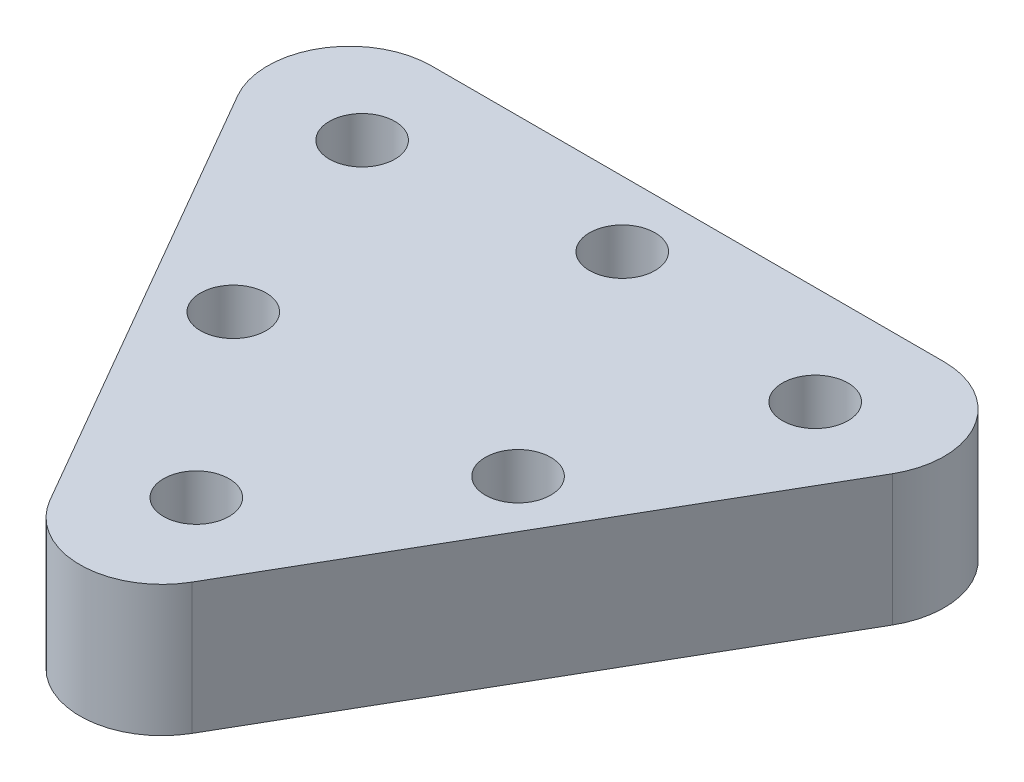
ISO-10303-21;
HEADER;
FILE_DESCRIPTION(('STEP AP214'),'2;1');
FILE_NAME('part.step','',(''),(''),'','','');
FILE_SCHEMA(('AUTOMOTIVE_DESIGN { 1 0 10303 214 1 1 1 1 }'));
ENDSEC;
DATA;
#1=APPLICATION_CONTEXT('core data for automotive mechanical design processes');
#2=APPLICATION_PROTOCOL_DEFINITION('international standard','automotive_design',2000,#1);
#3=PRODUCT_CONTEXT('',#1,'mechanical');
#4=PRODUCT('Part','Part','',(#3));
#5=PRODUCT_RELATED_PRODUCT_CATEGORY('part','',(#4));
#6=PRODUCT_DEFINITION_FORMATION('','',#4);
#7=PRODUCT_DEFINITION_CONTEXT('part definition',#1,'design');
#8=PRODUCT_DEFINITION('design','',#6,#7);
#9=PRODUCT_DEFINITION_SHAPE('','',#8);
#10=(LENGTH_UNIT() NAMED_UNIT(*) SI_UNIT(.MILLI.,.METRE.));
#11=(NAMED_UNIT(*) PLANE_ANGLE_UNIT() SI_UNIT($,.RADIAN.));
#12=(NAMED_UNIT(*) SI_UNIT($,.STERADIAN.) SOLID_ANGLE_UNIT());
#13=UNCERTAINTY_MEASURE_WITH_UNIT(LENGTH_MEASURE(1.E-05),#10,'distance_accuracy_value','');
#14=(GEOMETRIC_REPRESENTATION_CONTEXT(3) GLOBAL_UNCERTAINTY_ASSIGNED_CONTEXT((#13)) GLOBAL_UNIT_ASSIGNED_CONTEXT((#10,
#11,#12)) REPRESENTATION_CONTEXT('',''));
#15=CARTESIAN_POINT('',(0.,0.,0.));
#16=DIRECTION('',(0.,0.,1.));
#17=DIRECTION('',(1.,0.,0.));
#18=AXIS2_PLACEMENT_3D('',#15,#16,#17);
#19=CARTESIAN_POINT('',(-16.4111309816013,0.,1.40670066691386));
#20=DIRECTION('',(0.,1.,0.));
#21=DIRECTION('',(0.,0.,1.));
#22=AXIS2_PLACEMENT_3D('',#19,#20,#21);
#23=PLANE('',#22);
#24=CARTESIAN_POINT('',(0.457896150652304,0.,2.45939375576491));
#25=DIRECTION('',(0.,-1.,0.));
#26=DIRECTION('',(0.,0.,-1.));
#27=AXIS2_PLACEMENT_3D('',#24,#25,#26);
#28=CIRCLE('',#27,0.999999999999989);
#29=CARTESIAN_POINT('',(0.457896150652304,0.,1.45939375576492));
#30=VERTEX_POINT('',#29);
#31=EDGE_CURVE('E168',#30,#30,#28,.T.);
#32=ORIENTED_EDGE('',*,*,#31,.F.);
#33=EDGE_LOOP('',(#32));
#34=FACE_BOUND('',#33,.T.);
#35=CARTESIAN_POINT('',(9.14769453551465,0.,2.45939375576486));
#36=DIRECTION('',(0.,-1.,0.));
#37=DIRECTION('',(0.,0.,-1.));
#38=AXIS2_PLACEMENT_3D('',#35,#36,#37);
#39=CIRCLE('',#38,0.999999999999989);
#40=CARTESIAN_POINT('',(9.14769453551465,0.,1.45939375576487));
#41=VERTEX_POINT('',#40);
#42=EDGE_CURVE('E158',#41,#41,#39,.T.);
#43=ORIENTED_EDGE('',*,*,#42,.F.);
#44=EDGE_LOOP('',(#43));
#45=FACE_BOUND('',#44,.T.);
#46=CARTESIAN_POINT('',(4.80279534308345,0.,-5.06619239929081));
#47=DIRECTION('',(0.,-1.,0.));
#48=DIRECTION('',(0.,0.,-1.));
#49=AXIS2_PLACEMENT_3D('',#46,#47,#48);
#50=CIRCLE('',#49,0.999999999999989);
#51=CARTESIAN_POINT('',(4.80279534308345,0.,-6.06619239929079));
#52=VERTEX_POINT('',#51);
#53=EDGE_CURVE('E155',#52,#52,#50,.T.);
#54=ORIENTED_EDGE('',*,*,#53,.F.);
#55=EDGE_LOOP('',(#54));
#56=FACE_BOUND('',#55,.T.);
#57=CARTESIAN_POINT('',(4.80279534308345,0.,-0.0491349625871208));
#58=DIRECTION('',(0.,-1.,0.));
#59=DIRECTION('',(0.,0.,-1.));
#60=AXIS2_PLACEMENT_3D('',#57,#58,#59);
#61=CIRCLE('',#60,0.799999999999999);
#62=CARTESIAN_POINT('',(4.80279534308345,0.,-0.84913496258712));
#63=VERTEX_POINT('',#62);
#64=EDGE_CURVE('E154',#63,#63,#61,.T.);
#65=ORIENTED_EDGE('',*,*,#64,.F.);
#66=EDGE_LOOP('',(#65));
#67=FACE_BOUND('',#66,.T.);
#68=CARTESIAN_POINT('',(11.71622639985,0.,-4.04060624423512));
#69=DIRECTION('',(0.,1.,0.));
#70=DIRECTION('',(0.,0.,1.));
#71=AXIS2_PLACEMENT_3D('',#68,#69,#70);
#72=CIRCLE('',#71,2.38124999999938);
#73=CARTESIAN_POINT('',(11.71622639985,0.,-1.65935624423574));
#74=VERTEX_POINT('',#73);
#75=EDGE_CURVE('E181',#74,#74,#72,.T.);
#76=ORIENTED_EDGE('',*,*,#75,.T.);
#77=EDGE_LOOP('',(#76));
#78=FACE_BOUND('',#77,.T.);
#79=CARTESIAN_POINT('',(4.80279534308331,0.,8.98497991082108));
#80=DIRECTION('',(0.,1.,0.));
#81=DIRECTION('',(0.,0.,1.));
#82=AXIS2_PLACEMENT_3D('',#79,#80,#81);
#83=CIRCLE('',#82,2.49999999999972);
#84=CARTESIAN_POINT('',(6.96785885254439,0.,10.2349799108209));
#85=VERTEX_POINT('',#84);
#86=CARTESIAN_POINT('',(2.63773183362258,0.,10.2349799108209));
#87=VERTEX_POINT('',#86);
#88=EDGE_CURVE('E126',#85,#87,#83,.F.);
#89=ORIENTED_EDGE('',*,*,#88,.T.);
#90=DIRECTION('',(0.500000000000009,0.,0.866025403784434));
#91=VECTOR('',#90,1.);
#92=CARTESIAN_POINT('',(-5.94724091864677,0.,-4.63462907770371));
#93=LINE('',#92,#91);
#94=CARTESIAN_POINT('',(-5.18604114745575,0.,-3.3161923992911));
#95=VERTEX_POINT('',#94);
#96=EDGE_CURVE('E139',#95,#87,#93,.T.);
#97=ORIENTED_EDGE('',*,*,#96,.F.);
#98=CARTESIAN_POINT('',(-3.02097763799502,0.,-4.56619239929088));
#99=DIRECTION('',(0.,1.,0.));
#100=DIRECTION('',(0.,0.,1.));
#101=AXIS2_PLACEMENT_3D('',#98,#99,#100);
#102=CIRCLE('',#101,2.49999999999975);
#103=CARTESIAN_POINT('',(-3.02097763799485,0.,-7.06619239929081));
#104=VERTEX_POINT('',#103);
#105=EDGE_CURVE('E137',#95,#104,#102,.F.);
#106=ORIENTED_EDGE('',*,*,#105,.T.);
#107=DIRECTION('',(-1.,0.,0.));
#108=VECTOR('',#107,1.);
#109=CARTESIAN_POINT('',(-16.4111309816013,0.,-7.06619239929081));
#110=LINE('',#109,#108);
#111=CARTESIAN_POINT('',(12.6265683241618,0.,-7.06619239929081));
#112=VERTEX_POINT('',#111);
#113=EDGE_CURVE('E109',#112,#104,#110,.T.);
#114=ORIENTED_EDGE('',*,*,#113,.F.);
#115=CARTESIAN_POINT('',(12.6265683241616,0.,-4.56619239929093));
#116=DIRECTION('',(0.,1.,0.));
#117=DIRECTION('',(0.,0.,1.));
#118=AXIS2_PLACEMENT_3D('',#115,#116,#117);
#119=CIRCLE('',#118,2.49999999999987);
#120=CARTESIAN_POINT('',(14.7916318336227,0.,-3.31619239929111));
#121=VERTEX_POINT('',#120);
#122=EDGE_CURVE('E133',#121,#112,#119,.T.);
#123=ORIENTED_EDGE('',*,*,#122,.F.);
#124=DIRECTION('',(0.500000000000006,0.,-0.866025403784435));
#125=VECTOR('',#124,1.);
#126=CARTESIAN_POINT('',(4.94586844247103,0.,13.7371700334849));
#127=LINE('',#126,#125);
#128=EDGE_CURVE('E129',#85,#121,#127,.T.);
#129=ORIENTED_EDGE('',*,*,#128,.F.);
#130=EDGE_LOOP('',(#89,#97,#106,#114,#123,#129));
#131=FACE_BOUND('',#130,.T.);
#132=CARTESIAN_POINT('',(4.80279534308406,0.,7.93380760070919));
#133=DIRECTION('',(0.,1.,0.));
#134=DIRECTION('',(0.,0.,1.));
#135=AXIS2_PLACEMENT_3D('',#132,#133,#134);
#136=CIRCLE('',#135,2.38124999999972);
#137=CARTESIAN_POINT('',(4.80279534308406,0.,10.3150576007089));
#138=VERTEX_POINT('',#137);
#139=EDGE_CURVE('E184',#138,#138,#136,.T.);
#140=ORIENTED_EDGE('',*,*,#139,.T.);
#141=EDGE_LOOP('',(#140));
#142=FACE_BOUND('',#141,.T.);
#143=CARTESIAN_POINT('',(-2.11063571368305,0.,-4.04060624423513));
#144=DIRECTION('',(0.,1.,0.));
#145=DIRECTION('',(0.,0.,1.));
#146=AXIS2_PLACEMENT_3D('',#143,#144,#145);
#147=CIRCLE('',#146,2.38124999999953);
#148=CARTESIAN_POINT('',(-2.11063571368305,0.,-1.6593562442356));
#149=VERTEX_POINT('',#148);
#150=EDGE_CURVE('E151',#149,#149,#147,.T.);
#151=ORIENTED_EDGE('',*,*,#150,.T.);
#152=EDGE_LOOP('',(#151));
#153=FACE_BOUND('',#152,.T.);
#154=ADVANCED_FACE('F33',(#34,#45,#56,#67,#78,#131,#142,#153),#23,.F.);
#155=CARTESIAN_POINT('',(4.80279534308331,4.,8.98497991082108));
#156=DIRECTION('',(0.,-1.,0.));
#157=DIRECTION('',(0.,0.,-1.));
#158=AXIS2_PLACEMENT_3D('',#155,#156,#157);
#159=CYLINDRICAL_SURFACE('',#158,2.49999999999972);
#160=ORIENTED_EDGE('',*,*,#88,.F.);
#161=DIRECTION('',(0.,-1.,0.));
#162=VECTOR('',#161,1.);
#163=CARTESIAN_POINT('',(6.96785885254439,4.,10.2349799108209));
#164=LINE('',#163,#162);
#165=CARTESIAN_POINT('',(6.96785885254439,4.,10.2349799108209));
#166=VERTEX_POINT('',#165);
#167=EDGE_CURVE('E11',#166,#85,#164,.T.);
#168=ORIENTED_EDGE('',*,*,#167,.F.);
#169=CARTESIAN_POINT('',(4.80279534308331,4.,8.98497991082108));
#170=DIRECTION('',(0.,1.,0.));
#171=DIRECTION('',(0.,0.,1.));
#172=AXIS2_PLACEMENT_3D('',#169,#170,#171);
#173=CIRCLE('',#172,2.49999999999972);
#174=CARTESIAN_POINT('',(2.63773183362258,4.,10.2349799108209));
#175=VERTEX_POINT('',#174);
#176=EDGE_CURVE('E199',#166,#175,#173,.F.);
#177=ORIENTED_EDGE('',*,*,#176,.T.);
#178=DIRECTION('',(0.,-1.,0.));
#179=VECTOR('',#178,1.);
#180=CARTESIAN_POINT('',(2.63773183362258,4.,10.2349799108209));
#181=LINE('',#180,#179);
#182=EDGE_CURVE('E81',#175,#87,#181,.T.);
#183=ORIENTED_EDGE('',*,*,#182,.T.);
#184=EDGE_LOOP('',(#160,#168,#177,#183));
#185=FACE_BOUND('',#184,.T.);
#186=ADVANCED_FACE('F211',(#185),#159,.T.);
#187=CARTESIAN_POINT('',(4.94586844247103,4.,13.7371700334849));
#188=DIRECTION('',(-0.866025403784435,0.,-0.500000000000006));
#189=DIRECTION('',(-0.500000000000006,0.,0.866025403784435));
#190=AXIS2_PLACEMENT_3D('',#187,#188,#189);
#191=PLANE('',#190);
#192=ORIENTED_EDGE('',*,*,#128,.T.);
#193=DIRECTION('',(0.,-1.,0.));
#194=VECTOR('',#193,1.);
#195=CARTESIAN_POINT('',(14.7916318336227,4.,-3.31619239929111));
#196=LINE('',#195,#194);
#197=CARTESIAN_POINT('',(14.7916318336227,4.,-3.31619239929111));
#198=VERTEX_POINT('',#197);
#199=EDGE_CURVE('E43',#198,#121,#196,.T.);
#200=ORIENTED_EDGE('',*,*,#199,.F.);
#201=DIRECTION('',(0.500000000000006,0.,-0.866025403784435));
#202=VECTOR('',#201,1.);
#203=CARTESIAN_POINT('',(4.94586844247103,4.,13.7371700334849));
#204=LINE('',#203,#202);
#205=EDGE_CURVE('E201',#166,#198,#204,.T.);
#206=ORIENTED_EDGE('',*,*,#205,.F.);
#207=ORIENTED_EDGE('',*,*,#167,.T.);
#208=EDGE_LOOP('',(#192,#200,#206,#207));
#209=FACE_BOUND('',#208,.T.);
#210=ADVANCED_FACE('F204',(#209),#191,.F.);
#211=CARTESIAN_POINT('',(12.6265683241616,4.,-4.56619239929093));
#212=DIRECTION('',(0.,-1.,0.));
#213=DIRECTION('',(0.,0.,-1.));
#214=AXIS2_PLACEMENT_3D('',#211,#212,#213);
#215=CYLINDRICAL_SURFACE('',#214,2.49999999999987);
#216=ORIENTED_EDGE('',*,*,#122,.T.);
#217=DIRECTION('',(0.,-1.,0.));
#218=VECTOR('',#217,1.);
#219=CARTESIAN_POINT('',(12.6265683241618,4.,-7.06619239929081));
#220=LINE('',#219,#218);
#221=CARTESIAN_POINT('',(12.6265683241618,4.,-7.06619239929081));
#222=VERTEX_POINT('',#221);
#223=EDGE_CURVE('E113',#222,#112,#220,.T.);
#224=ORIENTED_EDGE('',*,*,#223,.F.);
#225=CARTESIAN_POINT('',(12.6265683241616,4.,-4.56619239929093));
#226=DIRECTION('',(0.,1.,0.));
#227=DIRECTION('',(0.,0.,1.));
#228=AXIS2_PLACEMENT_3D('',#225,#226,#227);
#229=CIRCLE('',#228,2.49999999999987);
#230=EDGE_CURVE('E101',#198,#222,#229,.T.);
#231=ORIENTED_EDGE('',*,*,#230,.F.);
#232=ORIENTED_EDGE('',*,*,#199,.T.);
#233=EDGE_LOOP('',(#216,#224,#231,#232));
#234=FACE_BOUND('',#233,.T.);
#235=ADVANCED_FACE('F207',(#234),#215,.T.);
#236=CARTESIAN_POINT('',(-16.4111309816013,4.,-7.06619239929081));
#237=DIRECTION('',(0.,0.,1.));
#238=DIRECTION('',(1.,0.,0.));
#239=AXIS2_PLACEMENT_3D('',#236,#237,#238);
#240=PLANE('',#239);
#241=ORIENTED_EDGE('',*,*,#113,.T.);
#242=DIRECTION('',(0.,-1.,0.));
#243=VECTOR('',#242,1.);
#244=CARTESIAN_POINT('',(-3.02097763799485,4.,-7.06619239929081));
#245=LINE('',#244,#243);
#246=CARTESIAN_POINT('',(-3.02097763799485,4.,-7.06619239929081));
#247=VERTEX_POINT('',#246);
#248=EDGE_CURVE('E107',#247,#104,#245,.T.);
#249=ORIENTED_EDGE('',*,*,#248,.F.);
#250=DIRECTION('',(-1.,0.,0.));
#251=VECTOR('',#250,1.);
#252=CARTESIAN_POINT('',(-16.4111309816013,4.,-7.06619239929081));
#253=LINE('',#252,#251);
#254=EDGE_CURVE('E94',#222,#247,#253,.T.);
#255=ORIENTED_EDGE('',*,*,#254,.F.);
#256=ORIENTED_EDGE('',*,*,#223,.T.);
#257=EDGE_LOOP('',(#241,#249,#255,#256));
#258=FACE_BOUND('',#257,.T.);
#259=ADVANCED_FACE('F108',(#258),#240,.F.);
#260=CARTESIAN_POINT('',(-3.02097763799502,4.,-4.56619239929088));
#261=DIRECTION('',(0.,-1.,0.));
#262=DIRECTION('',(0.,0.,-1.));
#263=AXIS2_PLACEMENT_3D('',#260,#261,#262);
#264=CYLINDRICAL_SURFACE('',#263,2.49999999999975);
#265=ORIENTED_EDGE('',*,*,#105,.F.);
#266=DIRECTION('',(0.,-1.,0.));
#267=VECTOR('',#266,1.);
#268=CARTESIAN_POINT('',(-5.18604114745575,4.,-3.3161923992911));
#269=LINE('',#268,#267);
#270=CARTESIAN_POINT('',(-5.18604114745575,4.,-3.3161923992911));
#271=VERTEX_POINT('',#270);
#272=EDGE_CURVE('E74',#271,#95,#269,.T.);
#273=ORIENTED_EDGE('',*,*,#272,.F.);
#274=CARTESIAN_POINT('',(-3.02097763799502,4.,-4.56619239929088));
#275=DIRECTION('',(0.,1.,0.));
#276=DIRECTION('',(0.,0.,1.));
#277=AXIS2_PLACEMENT_3D('',#274,#275,#276);
#278=CIRCLE('',#277,2.49999999999975);
#279=EDGE_CURVE('E99',#271,#247,#278,.F.);
#280=ORIENTED_EDGE('',*,*,#279,.T.);
#281=ORIENTED_EDGE('',*,*,#248,.T.);
#282=EDGE_LOOP('',(#265,#273,#280,#281));
#283=FACE_BOUND('',#282,.T.);
#284=ADVANCED_FACE('F115',(#283),#264,.T.);
#285=CARTESIAN_POINT('',(4.80279534308406,4.,7.93380760070919));
#286=DIRECTION('',(0.,-1.,0.));
#287=DIRECTION('',(0.,0.,-1.));
#288=AXIS2_PLACEMENT_3D('',#285,#286,#287);
#289=CYLINDRICAL_SURFACE('',#288,0.999999999998708);
#290=CARTESIAN_POINT('',(4.80279534308406,2.,7.93380760070919));
#291=DIRECTION('',(0.,1.,0.));
#292=DIRECTION('',(0.,0.,1.));
#293=AXIS2_PLACEMENT_3D('',#290,#291,#292);
#294=CIRCLE('',#293,0.999999999998708);
#295=CARTESIAN_POINT('',(4.80279534308406,2.,8.9338076007079));
#296=VERTEX_POINT('',#295);
#297=EDGE_CURVE('E190',#296,#296,#294,.T.);
#298=ORIENTED_EDGE('',*,*,#297,.F.);
#299=EDGE_LOOP('',(#298));
#300=FACE_BOUND('',#299,.T.);
#301=CARTESIAN_POINT('',(4.80279534308406,4.,7.93380760070919));
#302=DIRECTION('',(0.,1.,0.));
#303=DIRECTION('',(0.,0.,1.));
#304=AXIS2_PLACEMENT_3D('',#301,#302,#303);
#305=CIRCLE('',#304,0.999999999998708);
#306=CARTESIAN_POINT('',(4.80279534308406,4.,8.9338076007079));
#307=VERTEX_POINT('',#306);
#308=EDGE_CURVE('E117',#307,#307,#305,.T.);
#309=ORIENTED_EDGE('',*,*,#308,.T.);
#310=EDGE_LOOP('',(#309));
#311=FACE_BOUND('',#310,.T.);
#312=ADVANCED_FACE('F228',(#300,#311),#289,.F.);
#313=CARTESIAN_POINT('',(-5.94724091864677,4.,-4.63462907770371));
#314=DIRECTION('',(0.866025403784433,0.,-0.500000000000009));
#315=DIRECTION('',(-0.500000000000009,0.,-0.866025403784434));
#316=AXIS2_PLACEMENT_3D('',#313,#314,#315);
#317=PLANE('',#316);
#318=ORIENTED_EDGE('',*,*,#96,.T.);
#319=ORIENTED_EDGE('',*,*,#182,.F.);
#320=DIRECTION('',(0.500000000000009,0.,0.866025403784434));
#321=VECTOR('',#320,1.);
#322=CARTESIAN_POINT('',(-5.94724091864677,4.,-4.63462907770371));
#323=LINE('',#322,#321);
#324=EDGE_CURVE('E52',#271,#175,#323,.T.);
#325=ORIENTED_EDGE('',*,*,#324,.F.);
#326=ORIENTED_EDGE('',*,*,#272,.T.);
#327=EDGE_LOOP('',(#318,#319,#325,#326));
#328=FACE_BOUND('',#327,.T.);
#329=ADVANCED_FACE('F210',(#328),#317,.F.);
#330=CARTESIAN_POINT('',(-2.11063571368305,4.,-4.04060624423513));
#331=DIRECTION('',(0.,-1.,0.));
#332=DIRECTION('',(0.,0.,-1.));
#333=AXIS2_PLACEMENT_3D('',#330,#331,#332);
#334=CYLINDRICAL_SURFACE('',#333,0.999999999999094);
#335=CARTESIAN_POINT('',(-2.11063571368305,2.,-4.04060624423513));
#336=DIRECTION('',(0.,1.,0.));
#337=DIRECTION('',(0.,0.,1.));
#338=AXIS2_PLACEMENT_3D('',#335,#336,#337);
#339=CIRCLE('',#338,0.999999999999094);
#340=CARTESIAN_POINT('',(-2.11063571368305,2.,-3.04060624423603));
#341=VERTEX_POINT('',#340);
#342=EDGE_CURVE('E147',#341,#341,#339,.T.);
#343=ORIENTED_EDGE('',*,*,#342,.F.);
#344=EDGE_LOOP('',(#343));
#345=FACE_BOUND('',#344,.T.);
#346=CARTESIAN_POINT('',(-2.11063571368305,4.,-4.04060624423513));
#347=DIRECTION('',(0.,1.,0.));
#348=DIRECTION('',(0.,0.,1.));
#349=AXIS2_PLACEMENT_3D('',#346,#347,#348);
#350=CIRCLE('',#349,0.999999999999094);
#351=CARTESIAN_POINT('',(-2.11063571368305,4.,-3.04060624423603));
#352=VERTEX_POINT('',#351);
#353=EDGE_CURVE('E141',#352,#352,#350,.T.);
#354=ORIENTED_EDGE('',*,*,#353,.T.);
#355=EDGE_LOOP('',(#354));
#356=FACE_BOUND('',#355,.T.);
#357=ADVANCED_FACE('F35',(#345,#356),#334,.F.);
#358=CARTESIAN_POINT('',(11.71622639985,4.,-4.04060624423512));
#359=DIRECTION('',(0.,-1.,0.));
#360=DIRECTION('',(0.,0.,-1.));
#361=AXIS2_PLACEMENT_3D('',#358,#359,#360);
#362=CYLINDRICAL_SURFACE('',#361,0.99999999999917);
#363=CARTESIAN_POINT('',(11.71622639985,2.,-4.04060624423512));
#364=DIRECTION('',(0.,1.,0.));
#365=DIRECTION('',(0.,0.,1.));
#366=AXIS2_PLACEMENT_3D('',#363,#364,#365);
#367=CIRCLE('',#366,0.99999999999917);
#368=CARTESIAN_POINT('',(11.71622639985,2.,-3.04060624423595));
#369=VERTEX_POINT('',#368);
#370=EDGE_CURVE('E185',#369,#369,#367,.T.);
#371=ORIENTED_EDGE('',*,*,#370,.F.);
#372=EDGE_LOOP('',(#371));
#373=FACE_BOUND('',#372,.T.);
#374=CARTESIAN_POINT('',(11.71622639985,4.,-4.04060624423512));
#375=DIRECTION('',(0.,1.,0.));
#376=DIRECTION('',(0.,0.,1.));
#377=AXIS2_PLACEMENT_3D('',#374,#375,#376);
#378=CIRCLE('',#377,0.99999999999917);
#379=CARTESIAN_POINT('',(11.71622639985,4.,-3.04060624423595));
#380=VERTEX_POINT('',#379);
#381=EDGE_CURVE('E123',#380,#380,#378,.T.);
#382=ORIENTED_EDGE('',*,*,#381,.T.);
#383=EDGE_LOOP('',(#382));
#384=FACE_BOUND('',#383,.T.);
#385=ADVANCED_FACE('F234',(#373,#384),#362,.F.);
#386=CARTESIAN_POINT('',(-16.4111309816013,4.,1.40670066691386));
#387=DIRECTION('',(0.,1.,0.));
#388=DIRECTION('',(0.,0.,1.));
#389=AXIS2_PLACEMENT_3D('',#386,#387,#388);
#390=PLANE('',#389);
#391=CARTESIAN_POINT('',(0.457896150652304,4.,2.45939375576491));
#392=DIRECTION('',(0.,1.,0.));
#393=DIRECTION('',(0.,0.,1.));
#394=AXIS2_PLACEMENT_3D('',#391,#392,#393);
#395=CIRCLE('',#394,0.999999999999988);
#396=CARTESIAN_POINT('',(0.457896150652304,4.,3.4593937557649));
#397=VERTEX_POINT('',#396);
#398=EDGE_CURVE('E37',#397,#397,#395,.T.);
#399=ORIENTED_EDGE('',*,*,#398,.F.);
#400=EDGE_LOOP('',(#399));
#401=FACE_BOUND('',#400,.T.);
#402=CARTESIAN_POINT('',(9.14769453551465,4.,2.45939375576486));
#403=DIRECTION('',(0.,1.,0.));
#404=DIRECTION('',(0.,0.,1.));
#405=AXIS2_PLACEMENT_3D('',#402,#403,#404);
#406=CIRCLE('',#405,0.999999999999988);
#407=CARTESIAN_POINT('',(9.14769453551465,4.,3.45939375576485));
#408=VERTEX_POINT('',#407);
#409=EDGE_CURVE('E156',#408,#408,#406,.T.);
#410=ORIENTED_EDGE('',*,*,#409,.F.);
#411=EDGE_LOOP('',(#410));
#412=FACE_BOUND('',#411,.T.);
#413=CARTESIAN_POINT('',(4.80279534308345,4.,-5.06619239929081));
#414=DIRECTION('',(0.,1.,0.));
#415=DIRECTION('',(0.,0.,1.));
#416=AXIS2_PLACEMENT_3D('',#413,#414,#415);
#417=CIRCLE('',#416,0.999999999999988);
#418=CARTESIAN_POINT('',(4.80279534308345,4.,-4.06619239929082));
#419=VERTEX_POINT('',#418);
#420=EDGE_CURVE('E152',#419,#419,#417,.T.);
#421=ORIENTED_EDGE('',*,*,#420,.F.);
#422=EDGE_LOOP('',(#421));
#423=FACE_BOUND('',#422,.T.);
#424=ORIENTED_EDGE('',*,*,#353,.F.);
#425=EDGE_LOOP('',(#424));
#426=FACE_BOUND('',#425,.T.);
#427=ORIENTED_EDGE('',*,*,#176,.F.);
#428=ORIENTED_EDGE('',*,*,#205,.T.);
#429=ORIENTED_EDGE('',*,*,#230,.T.);
#430=ORIENTED_EDGE('',*,*,#254,.T.);
#431=ORIENTED_EDGE('',*,*,#279,.F.);
#432=ORIENTED_EDGE('',*,*,#324,.T.);
#433=EDGE_LOOP('',(#427,#428,#429,#430,#431,#432));
#434=FACE_BOUND('',#433,.T.);
#435=ORIENTED_EDGE('',*,*,#308,.F.);
#436=EDGE_LOOP('',(#435));
#437=FACE_BOUND('',#436,.T.);
#438=ORIENTED_EDGE('',*,*,#381,.F.);
#439=EDGE_LOOP('',(#438));
#440=FACE_BOUND('',#439,.T.);
#441=ADVANCED_FACE('F96',(#401,#412,#423,#426,#434,#437,#440),#390,.T.);
#442=CARTESIAN_POINT('',(4.80279534308406,2.,7.93380760070919));
#443=DIRECTION('',(0.,-1.,0.));
#444=DIRECTION('',(0.,0.,-1.));
#445=AXIS2_PLACEMENT_3D('',#442,#443,#444);
#446=CYLINDRICAL_SURFACE('',#445,2.38124999999972);
#447=CARTESIAN_POINT('',(4.80279534308406,2.,7.93380760070919));
#448=DIRECTION('',(0.,1.,0.));
#449=DIRECTION('',(0.,0.,1.));
#450=AXIS2_PLACEMENT_3D('',#447,#448,#449);
#451=CIRCLE('',#450,2.38124999999972);
#452=CARTESIAN_POINT('',(4.80279534308406,2.,10.3150576007089));
#453=VERTEX_POINT('',#452);
#454=EDGE_CURVE('E130',#453,#453,#451,.T.);
#455=ORIENTED_EDGE('',*,*,#454,.T.);
#456=EDGE_LOOP('',(#455));
#457=FACE_BOUND('',#456,.T.);
#458=ORIENTED_EDGE('',*,*,#139,.F.);
#459=EDGE_LOOP('',(#458));
#460=FACE_BOUND('',#459,.T.);
#461=ADVANCED_FACE('F240',(#457,#460),#446,.F.);
#462=CARTESIAN_POINT('',(-16.4111309816013,2.,1.40670066691386));
#463=DIRECTION('',(0.,1.,0.));
#464=DIRECTION('',(0.,0.,1.));
#465=AXIS2_PLACEMENT_3D('',#462,#463,#464);
#466=PLANE('',#465);
#467=ORIENTED_EDGE('',*,*,#297,.T.);
#468=EDGE_LOOP('',(#467));
#469=FACE_BOUND('',#468,.T.);
#470=ORIENTED_EDGE('',*,*,#454,.F.);
#471=EDGE_LOOP('',(#470));
#472=FACE_BOUND('',#471,.T.);
#473=ADVANCED_FACE('F244',(#469,#472),#466,.F.);
#474=CARTESIAN_POINT('',(11.71622639985,2.,-4.04060624423512));
#475=DIRECTION('',(0.,-1.,0.));
#476=DIRECTION('',(0.,0.,-1.));
#477=AXIS2_PLACEMENT_3D('',#474,#475,#476);
#478=CYLINDRICAL_SURFACE('',#477,2.38124999999938);
#479=CARTESIAN_POINT('',(11.71622639985,2.,-4.04060624423512));
#480=DIRECTION('',(0.,1.,0.));
#481=DIRECTION('',(0.,0.,1.));
#482=AXIS2_PLACEMENT_3D('',#479,#480,#481);
#483=CIRCLE('',#482,2.38124999999938);
#484=CARTESIAN_POINT('',(11.71622639985,2.,-1.65935624423574));
#485=VERTEX_POINT('',#484);
#486=EDGE_CURVE('E150',#485,#485,#483,.T.);
#487=ORIENTED_EDGE('',*,*,#486,.T.);
#488=EDGE_LOOP('',(#487));
#489=FACE_BOUND('',#488,.T.);
#490=ORIENTED_EDGE('',*,*,#75,.F.);
#491=EDGE_LOOP('',(#490));
#492=FACE_BOUND('',#491,.T.);
#493=ADVANCED_FACE('F248',(#489,#492),#478,.F.);
#494=CARTESIAN_POINT('',(-16.4111309816013,2.,1.40670066691386));
#495=DIRECTION('',(0.,1.,0.));
#496=DIRECTION('',(0.,0.,1.));
#497=AXIS2_PLACEMENT_3D('',#494,#495,#496);
#498=PLANE('',#497);
#499=ORIENTED_EDGE('',*,*,#370,.T.);
#500=EDGE_LOOP('',(#499));
#501=FACE_BOUND('',#500,.T.);
#502=ORIENTED_EDGE('',*,*,#486,.F.);
#503=EDGE_LOOP('',(#502));
#504=FACE_BOUND('',#503,.T.);
#505=ADVANCED_FACE('F250',(#501,#504),#498,.F.);
#506=CARTESIAN_POINT('',(-2.11063571368305,2.,-4.04060624423513));
#507=DIRECTION('',(0.,-1.,0.));
#508=DIRECTION('',(0.,0.,-1.));
#509=AXIS2_PLACEMENT_3D('',#506,#507,#508);
#510=CYLINDRICAL_SURFACE('',#509,2.38124999999953);
#511=CARTESIAN_POINT('',(-2.11063571368305,2.,-4.04060624423513));
#512=DIRECTION('',(0.,1.,0.));
#513=DIRECTION('',(0.,0.,1.));
#514=AXIS2_PLACEMENT_3D('',#511,#512,#513);
#515=CIRCLE('',#514,2.38124999999953);
#516=CARTESIAN_POINT('',(-2.11063571368305,2.,-1.6593562442356));
#517=VERTEX_POINT('',#516);
#518=EDGE_CURVE('E176',#517,#517,#515,.T.);
#519=ORIENTED_EDGE('',*,*,#518,.T.);
#520=EDGE_LOOP('',(#519));
#521=FACE_BOUND('',#520,.T.);
#522=ORIENTED_EDGE('',*,*,#150,.F.);
#523=EDGE_LOOP('',(#522));
#524=FACE_BOUND('',#523,.T.);
#525=ADVANCED_FACE('F253',(#521,#524),#510,.F.);
#526=CARTESIAN_POINT('',(-2.11063571368305,2.,-4.04060624423513));
#527=DIRECTION('',(0.,1.,0.));
#528=DIRECTION('',(0.,0.,1.));
#529=AXIS2_PLACEMENT_3D('',#526,#527,#528);
#530=PLANE('',#529);
#531=ORIENTED_EDGE('',*,*,#342,.T.);
#532=EDGE_LOOP('',(#531));
#533=FACE_BOUND('',#532,.T.);
#534=ORIENTED_EDGE('',*,*,#518,.F.);
#535=EDGE_LOOP('',(#534));
#536=FACE_BOUND('',#535,.T.);
#537=ADVANCED_FACE('F258',(#533,#536),#530,.F.);
#538=CARTESIAN_POINT('',(4.80279534308345,3.,-0.0491349625871208));
#539=DIRECTION('',(0.,-1.,0.));
#540=DIRECTION('',(0.,0.,-1.));
#541=AXIS2_PLACEMENT_3D('',#538,#539,#540);
#542=CONICAL_SURFACE('',#541,0.799999999999999,1.02974425867665);
#543=CARTESIAN_POINT('',(4.80279534308345,3.48068849522205,-0.0491349625871208));
#544=VERTEX_POINT('',#543);
#545=VERTEX_LOOP('',#544);
#546=FACE_BOUND('',#545,.T.);
#547=CARTESIAN_POINT('',(4.80279534308345,3.,-0.0491349625871208));
#548=DIRECTION('',(0.,-1.,0.));
#549=DIRECTION('',(0.,0.,-1.));
#550=AXIS2_PLACEMENT_3D('',#547,#548,#549);
#551=CIRCLE('',#550,0.799999999999999);
#552=CARTESIAN_POINT('',(4.80279534308345,3.,-0.84913496258712));
#553=VERTEX_POINT('',#552);
#554=EDGE_CURVE('E173',#553,#553,#551,.T.);
#555=ORIENTED_EDGE('',*,*,#554,.T.);
#556=EDGE_LOOP('',(#555));
#557=FACE_BOUND('',#556,.T.);
#558=ADVANCED_FACE('F261',(#546,#557),#542,.F.);
#559=CARTESIAN_POINT('',(4.80279534308345,0.,-0.0491349625871208));
#560=DIRECTION('',(0.,-1.,0.));
#561=DIRECTION('',(0.,0.,-1.));
#562=AXIS2_PLACEMENT_3D('',#559,#560,#561);
#563=CYLINDRICAL_SURFACE('',#562,0.799999999999999);
#564=ORIENTED_EDGE('',*,*,#554,.F.);
#565=EDGE_LOOP('',(#564));
#566=FACE_BOUND('',#565,.T.);
#567=ORIENTED_EDGE('',*,*,#64,.T.);
#568=EDGE_LOOP('',(#567));
#569=FACE_BOUND('',#568,.T.);
#570=ADVANCED_FACE('F268',(#566,#569),#563,.F.);
#571=CARTESIAN_POINT('',(4.80279534308345,0.,-5.06619239929081));
#572=DIRECTION('',(0.,-1.,0.));
#573=DIRECTION('',(0.,0.,-1.));
#574=AXIS2_PLACEMENT_3D('',#571,#572,#573);
#575=CYLINDRICAL_SURFACE('',#574,0.999999999999988);
#576=ORIENTED_EDGE('',*,*,#420,.T.);
#577=EDGE_LOOP('',(#576));
#578=FACE_BOUND('',#577,.T.);
#579=ORIENTED_EDGE('',*,*,#53,.T.);
#580=EDGE_LOOP('',(#579));
#581=FACE_BOUND('',#580,.T.);
#582=ADVANCED_FACE('F272',(#578,#581),#575,.F.);
#583=CARTESIAN_POINT('',(9.14769453551465,0.,2.45939375576486));
#584=DIRECTION('',(0.,-1.,0.));
#585=DIRECTION('',(0.,0.,-1.));
#586=AXIS2_PLACEMENT_3D('',#583,#584,#585);
#587=CYLINDRICAL_SURFACE('',#586,0.999999999999988);
#588=ORIENTED_EDGE('',*,*,#409,.T.);
#589=EDGE_LOOP('',(#588));
#590=FACE_BOUND('',#589,.T.);
#591=ORIENTED_EDGE('',*,*,#42,.T.);
#592=EDGE_LOOP('',(#591));
#593=FACE_BOUND('',#592,.T.);
#594=ADVANCED_FACE('F276',(#590,#593),#587,.F.);
#595=CARTESIAN_POINT('',(0.457896150652304,0.,2.45939375576491));
#596=DIRECTION('',(0.,-1.,0.));
#597=DIRECTION('',(0.,0.,-1.));
#598=AXIS2_PLACEMENT_3D('',#595,#596,#597);
#599=CYLINDRICAL_SURFACE('',#598,0.999999999999988);
#600=ORIENTED_EDGE('',*,*,#398,.T.);
#601=EDGE_LOOP('',(#600));
#602=FACE_BOUND('',#601,.T.);
#603=ORIENTED_EDGE('',*,*,#31,.T.);
#604=EDGE_LOOP('',(#603));
#605=FACE_BOUND('',#604,.T.);
#606=ADVANCED_FACE('F280',(#602,#605),#599,.F.);
#607=CLOSED_SHELL('',(#154,#186,#210,#235,#259,#284,#312,#329,#357,#385,#441,#461,#473,#493,
#505,#525,#537,#558,#570,#582,#594,#606));
#608=MANIFOLD_SOLID_BREP('B2',#607);
#609=ADVANCED_BREP_SHAPE_REPRESENTATION('',(#18,#608),#14);
#610=SHAPE_DEFINITION_REPRESENTATION(#9,#609);
ENDSEC;
END-ISO-10303-21;
